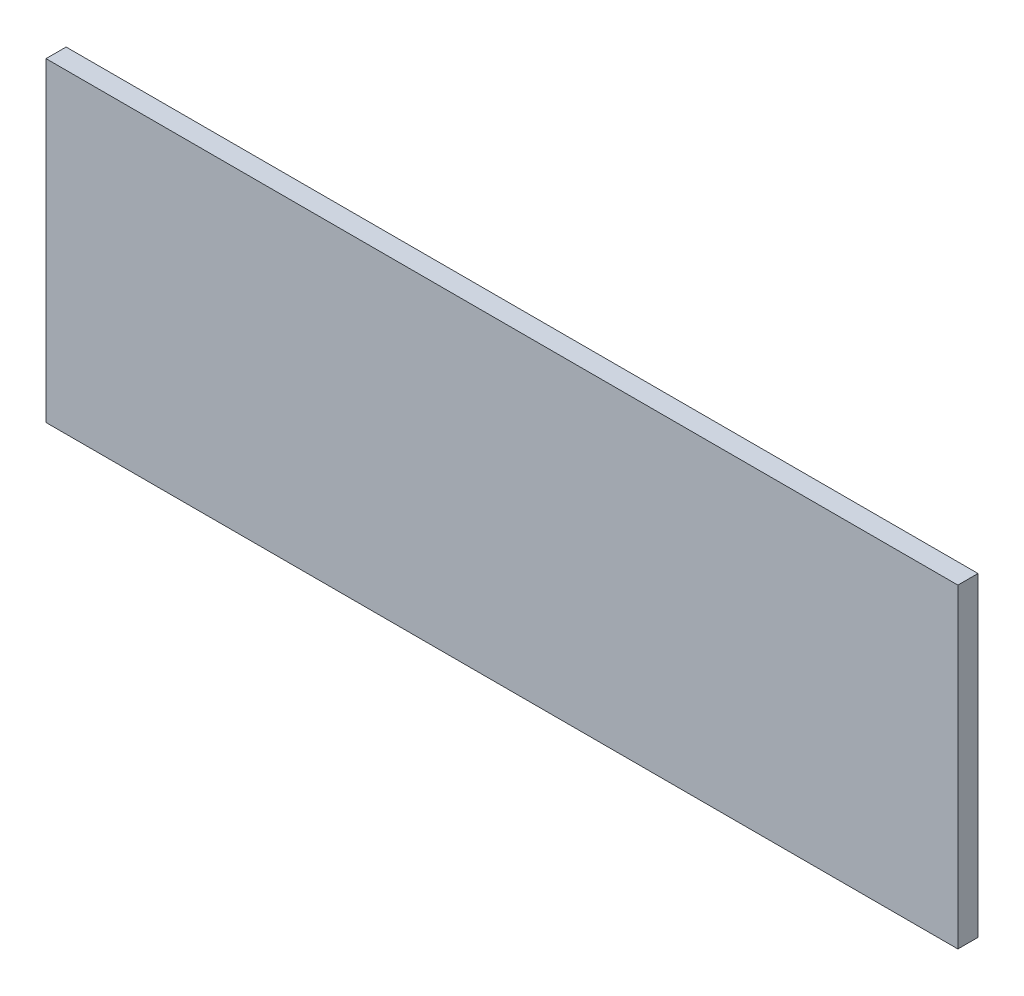
ISO-10303-21;
HEADER;
FILE_DESCRIPTION(('STEP AP214'),'2;1');
FILE_NAME('part.step','',(''),(''),'','','');
FILE_SCHEMA(('AUTOMOTIVE_DESIGN { 1 0 10303 214 1 1 1 1 }'));
ENDSEC;
DATA;
#1=APPLICATION_CONTEXT('core data for automotive mechanical design processes');
#2=APPLICATION_PROTOCOL_DEFINITION('international standard','automotive_design',2000,#1);
#3=PRODUCT_CONTEXT('',#1,'mechanical');
#4=PRODUCT('Part','Part','',(#3));
#5=PRODUCT_RELATED_PRODUCT_CATEGORY('part','',(#4));
#6=PRODUCT_DEFINITION_FORMATION('','',#4);
#7=PRODUCT_DEFINITION_CONTEXT('part definition',#1,'design');
#8=PRODUCT_DEFINITION('design','',#6,#7);
#9=PRODUCT_DEFINITION_SHAPE('','',#8);
#10=(LENGTH_UNIT() NAMED_UNIT(*) SI_UNIT(.MILLI.,.METRE.));
#11=(NAMED_UNIT(*) PLANE_ANGLE_UNIT() SI_UNIT($,.RADIAN.));
#12=(NAMED_UNIT(*) SI_UNIT($,.STERADIAN.) SOLID_ANGLE_UNIT());
#13=UNCERTAINTY_MEASURE_WITH_UNIT(LENGTH_MEASURE(1.E-05),#10,'distance_accuracy_value','');
#14=(GEOMETRIC_REPRESENTATION_CONTEXT(3) GLOBAL_UNCERTAINTY_ASSIGNED_CONTEXT((#13)) GLOBAL_UNIT_ASSIGNED_CONTEXT((#10,
#11,#12)) REPRESENTATION_CONTEXT('',''));
#15=CARTESIAN_POINT('',(0.,0.,0.));
#16=DIRECTION('',(0.,0.,1.));
#17=DIRECTION('',(1.,0.,0.));
#18=AXIS2_PLACEMENT_3D('',#15,#16,#17);
#19=CARTESIAN_POINT('',(-83.3544303797468,-0.0100000000000031,22.1518987341772));
#20=DIRECTION('',(-1.,0.,0.));
#21=DIRECTION('',(0.,0.,1.));
#22=AXIS2_PLACEMENT_3D('',#19,#20,#21);
#23=PLANE('',#22);
#24=DIRECTION('',(0.,1.,0.));
#25=VECTOR('',#24,1.);
#26=CARTESIAN_POINT('',(-83.3544303797468,-0.0100000000000031,19.1518987341772));
#27=LINE('',#26,#25);
#28=CARTESIAN_POINT('',(-83.3544303797468,0.,19.1518987341772));
#29=VERTEX_POINT('',#28);
#30=CARTESIAN_POINT('',(-83.3544303797468,47.,19.1518987341772));
#31=VERTEX_POINT('',#30);
#32=EDGE_CURVE('E36',#29,#31,#27,.T.);
#33=ORIENTED_EDGE('',*,*,#32,.F.);
#34=DIRECTION('',(0.,0.,1.));
#35=VECTOR('',#34,1.);
#36=CARTESIAN_POINT('',(-83.3544303797468,0.,0.));
#37=LINE('',#36,#35);
#38=CARTESIAN_POINT('',(-83.3544303797468,0.,22.1518987341772));
#39=VERTEX_POINT('',#38);
#40=EDGE_CURVE('E87',#29,#39,#37,.T.);
#41=ORIENTED_EDGE('',*,*,#40,.T.);
#42=DIRECTION('',(0.,1.,0.));
#43=VECTOR('',#42,1.);
#44=CARTESIAN_POINT('',(-83.3544303797468,-0.0100000000000031,22.1518987341772));
#45=LINE('',#44,#43);
#46=CARTESIAN_POINT('',(-83.3544303797468,47.,22.1518987341772));
#47=VERTEX_POINT('',#46);
#48=EDGE_CURVE('E98',#39,#47,#45,.T.);
#49=ORIENTED_EDGE('',*,*,#48,.T.);
#50=DIRECTION('',(0.,0.,1.));
#51=VECTOR('',#50,1.);
#52=CARTESIAN_POINT('',(-83.3544303797468,47.,0.));
#53=LINE('',#52,#51);
#54=EDGE_CURVE('E100',#31,#47,#53,.T.);
#55=ORIENTED_EDGE('',*,*,#54,.F.);
#56=EDGE_LOOP('',(#33,#41,#49,#55));
#57=FACE_BOUND('',#56,.T.);
#58=ADVANCED_FACE('F32',(#57),#23,.T.);
#59=CARTESIAN_POINT('',(52.6371308016878,-0.0100000000000031,22.1518987341772));
#60=DIRECTION('',(1.,0.,0.));
#61=DIRECTION('',(0.,0.,-1.));
#62=AXIS2_PLACEMENT_3D('',#59,#60,#61);
#63=PLANE('',#62);
#64=DIRECTION('',(0.,-1.,0.));
#65=VECTOR('',#64,1.);
#66=CARTESIAN_POINT('',(52.6371308016877,50.,22.1518987341772));
#67=LINE('',#66,#65);
#68=CARTESIAN_POINT('',(52.6371308016877,47.,22.1518987341772));
#69=VERTEX_POINT('',#68);
#70=CARTESIAN_POINT('',(52.6371308016878,0.,22.1518987341772));
#71=VERTEX_POINT('',#70);
#72=EDGE_CURVE('E79',#69,#71,#67,.T.);
#73=ORIENTED_EDGE('',*,*,#72,.T.);
#74=DIRECTION('',(0.,0.,-1.));
#75=VECTOR('',#74,1.);
#76=CARTESIAN_POINT('',(52.6371308016879,0.,2.43495644026E-13));
#77=LINE('',#76,#75);
#78=CARTESIAN_POINT('',(52.6371308016878,0.,19.1518987341772));
#79=VERTEX_POINT('',#78);
#80=EDGE_CURVE('E85',#71,#79,#77,.T.);
#81=ORIENTED_EDGE('',*,*,#80,.T.);
#82=DIRECTION('',(0.,1.,0.));
#83=VECTOR('',#82,1.);
#84=CARTESIAN_POINT('',(52.6371308016878,-0.0100000000000031,19.1518987341772));
#85=LINE('',#84,#83);
#86=CARTESIAN_POINT('',(52.6371308016878,47.,19.1518987341772));
#87=VERTEX_POINT('',#86);
#88=EDGE_CURVE('E71',#79,#87,#85,.T.);
#89=ORIENTED_EDGE('',*,*,#88,.T.);
#90=DIRECTION('',(0.,0.,-1.));
#91=VECTOR('',#90,1.);
#92=CARTESIAN_POINT('',(52.6371308016879,47.,2.43495644026E-13));
#93=LINE('',#92,#91);
#94=EDGE_CURVE('E99',#69,#87,#93,.T.);
#95=ORIENTED_EDGE('',*,*,#94,.F.);
#96=EDGE_LOOP('',(#73,#81,#89,#95));
#97=FACE_BOUND('',#96,.T.);
#98=ADVANCED_FACE('F89',(#97),#63,.T.);
#99=CARTESIAN_POINT('',(-98.3544303797468,47.,19.1518987341772));
#100=DIRECTION('',(0.,0.,-1.));
#101=DIRECTION('',(-1.,0.,0.));
#102=AXIS2_PLACEMENT_3D('',#99,#100,#101);
#103=PLANE('',#102);
#104=ORIENTED_EDGE('',*,*,#88,.F.);
#105=DIRECTION('',(-1.,0.,0.));
#106=VECTOR('',#105,1.);
#107=CARTESIAN_POINT('',(0.,0.,19.1518987341772));
#108=LINE('',#107,#106);
#109=EDGE_CURVE('E74',#79,#29,#108,.T.);
#110=ORIENTED_EDGE('',*,*,#109,.T.);
#111=ORIENTED_EDGE('',*,*,#32,.T.);
#112=DIRECTION('',(1.,0.,0.));
#113=VECTOR('',#112,1.);
#114=CARTESIAN_POINT('',(-98.3544303797468,47.,19.1518987341772));
#115=LINE('',#114,#113);
#116=EDGE_CURVE('E41',#31,#87,#115,.T.);
#117=ORIENTED_EDGE('',*,*,#116,.T.);
#118=EDGE_LOOP('',(#104,#110,#111,#117));
#119=FACE_BOUND('',#118,.T.);
#120=ADVANCED_FACE('F73',(#119),#103,.T.);
#121=CARTESIAN_POINT('',(0.,47.,0.));
#122=DIRECTION('',(0.,1.,0.));
#123=DIRECTION('',(0.,0.,1.));
#124=AXIS2_PLACEMENT_3D('',#121,#122,#123);
#125=PLANE('',#124);
#126=ORIENTED_EDGE('',*,*,#116,.F.);
#127=ORIENTED_EDGE('',*,*,#54,.T.);
#128=DIRECTION('',(1.,0.,0.));
#129=VECTOR('',#128,1.);
#130=CARTESIAN_POINT('',(-98.3544303797468,47.,22.1518987341772));
#131=LINE('',#130,#129);
#132=EDGE_CURVE('E11',#47,#69,#131,.T.);
#133=ORIENTED_EDGE('',*,*,#132,.T.);
#134=ORIENTED_EDGE('',*,*,#94,.T.);
#135=EDGE_LOOP('',(#126,#127,#133,#134));
#136=FACE_BOUND('',#135,.T.);
#137=ADVANCED_FACE('F104',(#136),#125,.T.);
#138=CARTESIAN_POINT('',(-98.3544303797468,50.,22.1518987341772));
#139=DIRECTION('',(0.,0.,-1.));
#140=DIRECTION('',(-1.,0.,0.));
#141=AXIS2_PLACEMENT_3D('',#138,#139,#140);
#142=PLANE('',#141);
#143=ORIENTED_EDGE('',*,*,#48,.F.);
#144=DIRECTION('',(1.,0.,0.));
#145=VECTOR('',#144,1.);
#146=CARTESIAN_POINT('',(-98.3544303797468,0.,22.1518987341772));
#147=LINE('',#146,#145);
#148=EDGE_CURVE('E93',#39,#71,#147,.T.);
#149=ORIENTED_EDGE('',*,*,#148,.T.);
#150=ORIENTED_EDGE('',*,*,#72,.F.);
#151=ORIENTED_EDGE('',*,*,#132,.F.);
#152=EDGE_LOOP('',(#143,#149,#150,#151));
#153=FACE_BOUND('',#152,.T.);
#154=ADVANCED_FACE('F34',(#153),#142,.F.);
#155=CARTESIAN_POINT('',(0.,0.,0.));
#156=DIRECTION('',(0.,1.,0.));
#157=DIRECTION('',(0.,0.,1.));
#158=AXIS2_PLACEMENT_3D('',#155,#156,#157);
#159=PLANE('',#158);
#160=ORIENTED_EDGE('',*,*,#40,.F.);
#161=ORIENTED_EDGE('',*,*,#109,.F.);
#162=ORIENTED_EDGE('',*,*,#80,.F.);
#163=ORIENTED_EDGE('',*,*,#148,.F.);
#164=EDGE_LOOP('',(#160,#161,#162,#163));
#165=FACE_BOUND('',#164,.T.);
#166=ADVANCED_FACE('F83',(#165),#159,.F.);
#167=CLOSED_SHELL('',(#58,#98,#120,#137,#154,#166));
#168=MANIFOLD_SOLID_BREP('B2',#167);
#169=ADVANCED_BREP_SHAPE_REPRESENTATION('',(#18,#168),#14);
#170=SHAPE_DEFINITION_REPRESENTATION(#9,#169);
ENDSEC;
END-ISO-10303-21;
